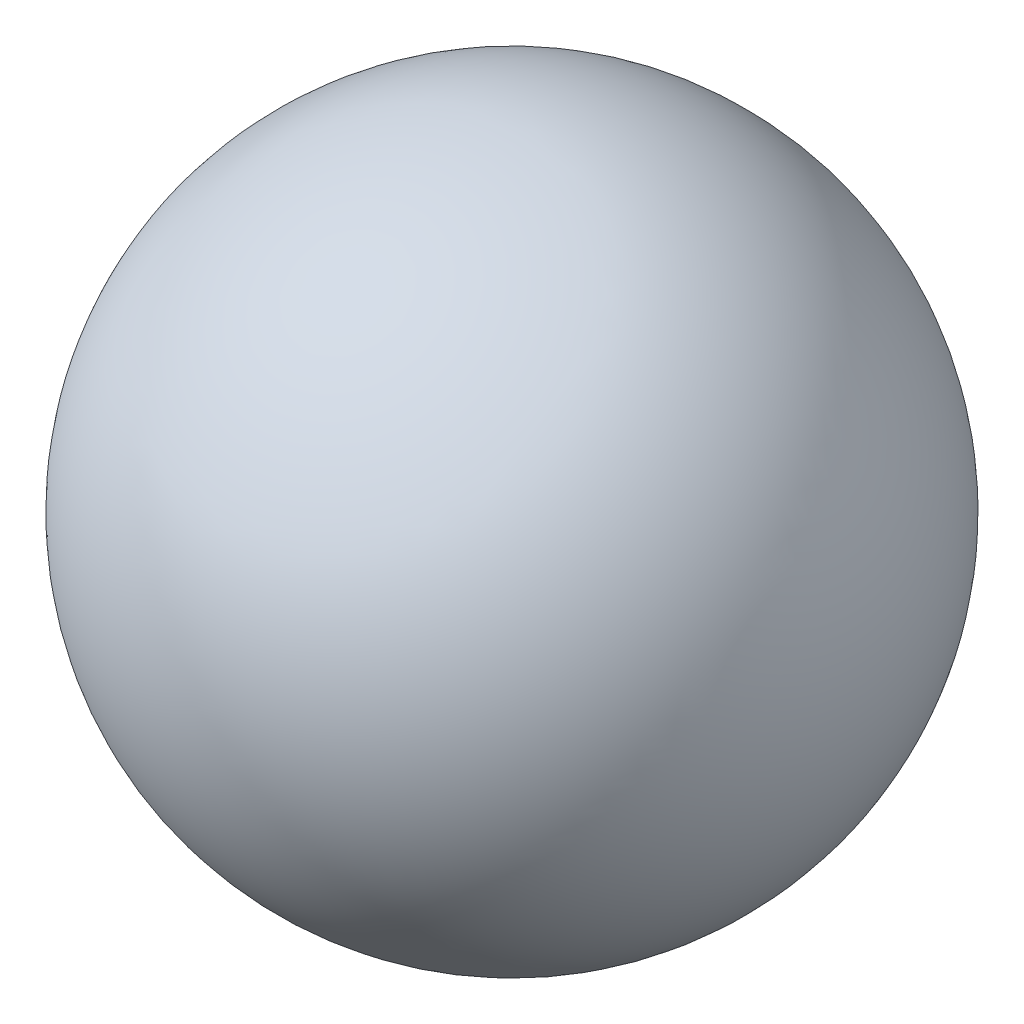
ISO-10303-21;
HEADER;
FILE_DESCRIPTION(('STEP AP214'),'2;1');
FILE_NAME('part.step','',(''),(''),'','','');
FILE_SCHEMA(('AUTOMOTIVE_DESIGN { 1 0 10303 214 1 1 1 1 }'));
ENDSEC;
DATA;
#1=APPLICATION_CONTEXT('core data for automotive mechanical design processes');
#2=APPLICATION_PROTOCOL_DEFINITION('international standard','automotive_design',2000,#1);
#3=PRODUCT_CONTEXT('',#1,'mechanical');
#4=PRODUCT('Part','Part','',(#3));
#5=PRODUCT_RELATED_PRODUCT_CATEGORY('part','',(#4));
#6=PRODUCT_DEFINITION_FORMATION('','',#4);
#7=PRODUCT_DEFINITION_CONTEXT('part definition',#1,'design');
#8=PRODUCT_DEFINITION('design','',#6,#7);
#9=PRODUCT_DEFINITION_SHAPE('','',#8);
#10=(LENGTH_UNIT() NAMED_UNIT(*) SI_UNIT(.MILLI.,.METRE.));
#11=(NAMED_UNIT(*) PLANE_ANGLE_UNIT() SI_UNIT($,.RADIAN.));
#12=(NAMED_UNIT(*) SI_UNIT($,.STERADIAN.) SOLID_ANGLE_UNIT());
#13=UNCERTAINTY_MEASURE_WITH_UNIT(LENGTH_MEASURE(1.E-05),#10,'distance_accuracy_value','');
#14=(GEOMETRIC_REPRESENTATION_CONTEXT(3) GLOBAL_UNCERTAINTY_ASSIGNED_CONTEXT((#13)) GLOBAL_UNIT_ASSIGNED_CONTEXT((#10,
#11,#12)) REPRESENTATION_CONTEXT('',''));
#15=CARTESIAN_POINT('',(0.,0.,0.));
#16=DIRECTION('',(0.,0.,1.));
#17=DIRECTION('',(1.,0.,0.));
#18=AXIS2_PLACEMENT_3D('',#15,#16,#17);
#19=CARTESIAN_POINT('',(0.,0.,0.));
#20=DIRECTION('',(-1.,0.,0.));
#21=DIRECTION('',(0.,1.,0.));
#22=AXIS2_PLACEMENT_3D('',#19,#20,#21);
#23=SPHERICAL_SURFACE('',#22,21.35);
#24=CARTESIAN_POINT('',(-21.35,0.,0.));
#25=VERTEX_POINT('',#24);
#26=VERTEX_LOOP('',#25);
#27=FACE_BOUND('',#26,.T.);
#28=ADVANCED_FACE('F26',(#27),#23,.T.);
#29=CLOSED_SHELL('',(#28));
#30=MANIFOLD_SOLID_BREP('B2',#29);
#31=ADVANCED_BREP_SHAPE_REPRESENTATION('',(#18,#30),#14);
#32=SHAPE_DEFINITION_REPRESENTATION(#9,#31);
ENDSEC;
END-ISO-10303-21;
